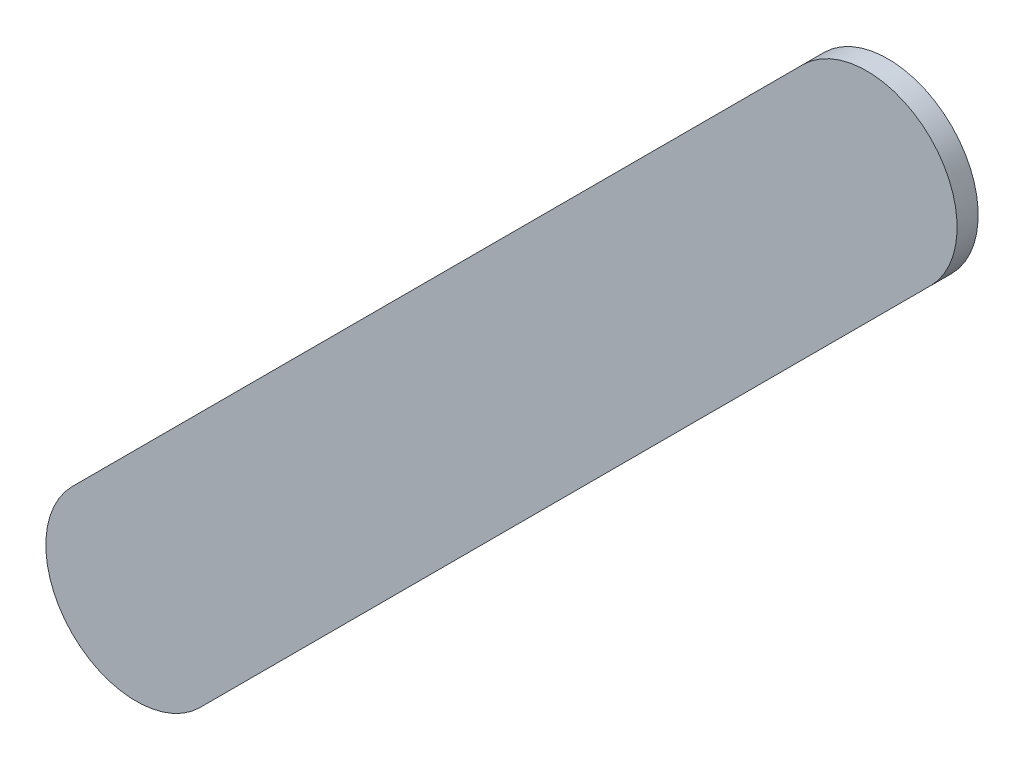
ISO-10303-21;
HEADER;
FILE_DESCRIPTION(('STEP AP214'),'2;1');
FILE_NAME('part.step','',(''),(''),'','','');
FILE_SCHEMA(('AUTOMOTIVE_DESIGN { 1 0 10303 214 1 1 1 1 }'));
ENDSEC;
DATA;
#1=APPLICATION_CONTEXT('core data for automotive mechanical design processes');
#2=APPLICATION_PROTOCOL_DEFINITION('international standard','automotive_design',2000,#1);
#3=PRODUCT_CONTEXT('',#1,'mechanical');
#4=PRODUCT('Part','Part','',(#3));
#5=PRODUCT_RELATED_PRODUCT_CATEGORY('part','',(#4));
#6=PRODUCT_DEFINITION_FORMATION('','',#4);
#7=PRODUCT_DEFINITION_CONTEXT('part definition',#1,'design');
#8=PRODUCT_DEFINITION('design','',#6,#7);
#9=PRODUCT_DEFINITION_SHAPE('','',#8);
#10=(LENGTH_UNIT() NAMED_UNIT(*) SI_UNIT(.MILLI.,.METRE.));
#11=(NAMED_UNIT(*) PLANE_ANGLE_UNIT() SI_UNIT($,.RADIAN.));
#12=(NAMED_UNIT(*) SI_UNIT($,.STERADIAN.) SOLID_ANGLE_UNIT());
#13=UNCERTAINTY_MEASURE_WITH_UNIT(LENGTH_MEASURE(1.E-05),#10,'distance_accuracy_value','');
#14=(GEOMETRIC_REPRESENTATION_CONTEXT(3) GLOBAL_UNCERTAINTY_ASSIGNED_CONTEXT((#13)) GLOBAL_UNIT_ASSIGNED_CONTEXT((#10,
#11,#12)) REPRESENTATION_CONTEXT('',''));
#15=CARTESIAN_POINT('',(0.,0.,0.));
#16=DIRECTION('',(0.,0.,1.));
#17=DIRECTION('',(1.,0.,0.));
#18=AXIS2_PLACEMENT_3D('',#15,#16,#17);
#19=CARTESIAN_POINT('',(118.257933,-68.473933,0.));
#20=DIRECTION('',(0.,0.,1.));
#21=DIRECTION('',(1.,0.,0.));
#22=AXIS2_PLACEMENT_3D('',#19,#20,#21);
#23=PLANE('',#22);
#24=DIRECTION('',(-0.707106781186548,-0.707106781186548,0.));
#25=VECTOR('',#24,1.);
#26=CARTESIAN_POINT('',(118.257933,-68.473933,0.));
#27=LINE('',#26,#25);
#28=CARTESIAN_POINT('',(118.257933,-68.473933,0.));
#29=VERTEX_POINT('',#28);
#30=CARTESIAN_POINT('',(117.043733,-69.688133,0.));
#31=VERTEX_POINT('',#30);
#32=EDGE_CURVE('E81',#29,#31,#27,.T.);
#33=ORIENTED_EDGE('',*,*,#32,.T.);
#34=CARTESIAN_POINT('',(117.1497995,-69.7941995,0.));
#35=DIRECTION('',(0.,0.,1.));
#36=DIRECTION('',(-0.707106781186548,0.707106781186548,0.));
#37=AXIS2_PLACEMENT_3D('',#34,#35,#36);
#38=CIRCLE('',#37,0.150000682813);
#39=CARTESIAN_POINT('',(117.255866,-69.900266,0.));
#40=VERTEX_POINT('',#39);
#41=EDGE_CURVE('E79',#31,#40,#38,.T.);
#42=ORIENTED_EDGE('',*,*,#41,.T.);
#43=DIRECTION('',(0.707106781186548,0.707106781186548,0.));
#44=VECTOR('',#43,1.);
#45=CARTESIAN_POINT('',(117.255866,-69.900266,0.));
#46=LINE('',#45,#44);
#47=CARTESIAN_POINT('',(118.470066,-68.686066,0.));
#48=VERTEX_POINT('',#47);
#49=EDGE_CURVE('E69',#40,#48,#46,.T.);
#50=ORIENTED_EDGE('',*,*,#49,.T.);
#51=CARTESIAN_POINT('',(118.3639995,-68.5799995,0.));
#52=DIRECTION('',(0.,0.,1.));
#53=DIRECTION('',(0.707106781186548,-0.707106781186548,0.));
#54=AXIS2_PLACEMENT_3D('',#51,#52,#53);
#55=CIRCLE('',#54,0.150000682813);
#56=EDGE_CURVE('E11',#48,#29,#55,.T.);
#57=ORIENTED_EDGE('',*,*,#56,.T.);
#58=EDGE_LOOP('',(#33,#42,#50,#57));
#59=FACE_BOUND('',#58,.T.);
#60=ADVANCED_FACE('F17',(#59),#23,.T.);
#61=CARTESIAN_POINT('',(118.257933,-68.473933,-0.035));
#62=DIRECTION('',(0.,0.,1.));
#63=DIRECTION('',(1.,0.,0.));
#64=AXIS2_PLACEMENT_3D('',#61,#62,#63);
#65=PLANE('',#64);
#66=CARTESIAN_POINT('',(118.3639995,-68.5799995,-0.035));
#67=DIRECTION('',(0.,0.,1.));
#68=DIRECTION('',(0.707106781186548,-0.707106781186548,0.));
#69=AXIS2_PLACEMENT_3D('',#66,#67,#68);
#70=CIRCLE('',#69,0.150000682813);
#71=CARTESIAN_POINT('',(118.470066,-68.686066,-0.035));
#72=VERTEX_POINT('',#71);
#73=CARTESIAN_POINT('',(118.257933,-68.473933,-0.035));
#74=VERTEX_POINT('',#73);
#75=EDGE_CURVE('E20',#72,#74,#70,.T.);
#76=ORIENTED_EDGE('',*,*,#75,.F.);
#77=DIRECTION('',(0.707106781186548,0.707106781186548,0.));
#78=VECTOR('',#77,1.);
#79=CARTESIAN_POINT('',(117.255866,-69.900266,-0.035));
#80=LINE('',#79,#78);
#81=CARTESIAN_POINT('',(117.255866,-69.900266,-0.035));
#82=VERTEX_POINT('',#81);
#83=EDGE_CURVE('E61',#82,#72,#80,.T.);
#84=ORIENTED_EDGE('',*,*,#83,.F.);
#85=CARTESIAN_POINT('',(117.1497995,-69.7941995,-0.035));
#86=DIRECTION('',(0.,0.,1.));
#87=DIRECTION('',(-0.707106781186548,0.707106781186548,0.));
#88=AXIS2_PLACEMENT_3D('',#85,#86,#87);
#89=CIRCLE('',#88,0.150000682813);
#90=CARTESIAN_POINT('',(117.043733,-69.688133,-0.035));
#91=VERTEX_POINT('',#90);
#92=EDGE_CURVE('E88',#91,#82,#89,.T.);
#93=ORIENTED_EDGE('',*,*,#92,.F.);
#94=DIRECTION('',(-0.707106781186548,-0.707106781186548,0.));
#95=VECTOR('',#94,1.);
#96=CARTESIAN_POINT('',(118.257933,-68.473933,-0.035));
#97=LINE('',#96,#95);
#98=EDGE_CURVE('E107',#74,#91,#97,.T.);
#99=ORIENTED_EDGE('',*,*,#98,.F.);
#100=EDGE_LOOP('',(#76,#84,#93,#99));
#101=FACE_BOUND('',#100,.T.);
#102=ADVANCED_FACE('F129',(#101),#65,.F.);
#103=CARTESIAN_POINT('',(118.3639995,-68.5799995,-0.035));
#104=DIRECTION('',(0.,0.,-1.));
#105=DIRECTION('',(0.707106781186548,-0.707106781186548,0.));
#106=AXIS2_PLACEMENT_3D('',#103,#104,#105);
#107=CYLINDRICAL_SURFACE('',#106,0.150000682813);
#108=ORIENTED_EDGE('',*,*,#75,.T.);
#109=DIRECTION('',(0.,0.,1.));
#110=VECTOR('',#109,1.);
#111=CARTESIAN_POINT('',(118.257933,-68.473933,-0.035));
#112=LINE('',#111,#110);
#113=EDGE_CURVE('E95',#74,#29,#112,.T.);
#114=ORIENTED_EDGE('',*,*,#113,.T.);
#115=ORIENTED_EDGE('',*,*,#56,.F.);
#116=DIRECTION('',(0.,0.,1.));
#117=VECTOR('',#116,1.);
#118=CARTESIAN_POINT('',(118.470066,-68.686066,-0.035));
#119=LINE('',#118,#117);
#120=EDGE_CURVE('E75',#72,#48,#119,.T.);
#121=ORIENTED_EDGE('',*,*,#120,.F.);
#122=EDGE_LOOP('',(#108,#114,#115,#121));
#123=FACE_BOUND('',#122,.T.);
#124=ADVANCED_FACE('F131',(#123),#107,.T.);
#125=CARTESIAN_POINT('',(117.255866,-69.900266,-0.035));
#126=DIRECTION('',(-0.707106781186548,0.707106781186548,0.));
#127=DIRECTION('',(0.,0.,1.));
#128=AXIS2_PLACEMENT_3D('',#125,#126,#127);
#129=PLANE('',#128);
#130=ORIENTED_EDGE('',*,*,#83,.T.);
#131=ORIENTED_EDGE('',*,*,#120,.T.);
#132=ORIENTED_EDGE('',*,*,#49,.F.);
#133=DIRECTION('',(0.,0.,1.));
#134=VECTOR('',#133,1.);
#135=CARTESIAN_POINT('',(117.255866,-69.900266,-0.035));
#136=LINE('',#135,#134);
#137=EDGE_CURVE('E73',#82,#40,#136,.T.);
#138=ORIENTED_EDGE('',*,*,#137,.F.);
#139=EDGE_LOOP('',(#130,#131,#132,#138));
#140=FACE_BOUND('',#139,.T.);
#141=ADVANCED_FACE('F71',(#140),#129,.F.);
#142=CARTESIAN_POINT('',(117.1497995,-69.7941995,-0.035));
#143=DIRECTION('',(0.,0.,-1.));
#144=DIRECTION('',(-0.707106781186548,0.707106781186548,0.));
#145=AXIS2_PLACEMENT_3D('',#142,#143,#144);
#146=CYLINDRICAL_SURFACE('',#145,0.150000682813);
#147=ORIENTED_EDGE('',*,*,#92,.T.);
#148=ORIENTED_EDGE('',*,*,#137,.T.);
#149=ORIENTED_EDGE('',*,*,#41,.F.);
#150=DIRECTION('',(0.,0.,1.));
#151=VECTOR('',#150,1.);
#152=CARTESIAN_POINT('',(117.043733,-69.688133,-0.035));
#153=LINE('',#152,#151);
#154=EDGE_CURVE('E115',#91,#31,#153,.T.);
#155=ORIENTED_EDGE('',*,*,#154,.F.);
#156=EDGE_LOOP('',(#147,#148,#149,#155));
#157=FACE_BOUND('',#156,.T.);
#158=ADVANCED_FACE('F87',(#157),#146,.T.);
#159=CARTESIAN_POINT('',(118.257933,-68.473933,-0.035));
#160=DIRECTION('',(0.707106781186548,-0.707106781186548,0.));
#161=DIRECTION('',(0.,0.,-1.));
#162=AXIS2_PLACEMENT_3D('',#159,#160,#161);
#163=PLANE('',#162);
#164=ORIENTED_EDGE('',*,*,#98,.T.);
#165=ORIENTED_EDGE('',*,*,#154,.T.);
#166=ORIENTED_EDGE('',*,*,#32,.F.);
#167=ORIENTED_EDGE('',*,*,#113,.F.);
#168=EDGE_LOOP('',(#164,#165,#166,#167));
#169=FACE_BOUND('',#168,.T.);
#170=ADVANCED_FACE('F128',(#169),#163,.F.);
#171=CLOSED_SHELL('',(#60,#102,#124,#141,#158,#170));
#172=MANIFOLD_SOLID_BREP('B1',#171);
#173=ADVANCED_BREP_SHAPE_REPRESENTATION('',(#18,#172),#14);
#174=SHAPE_DEFINITION_REPRESENTATION(#9,#173);
ENDSEC;
END-ISO-10303-21;
